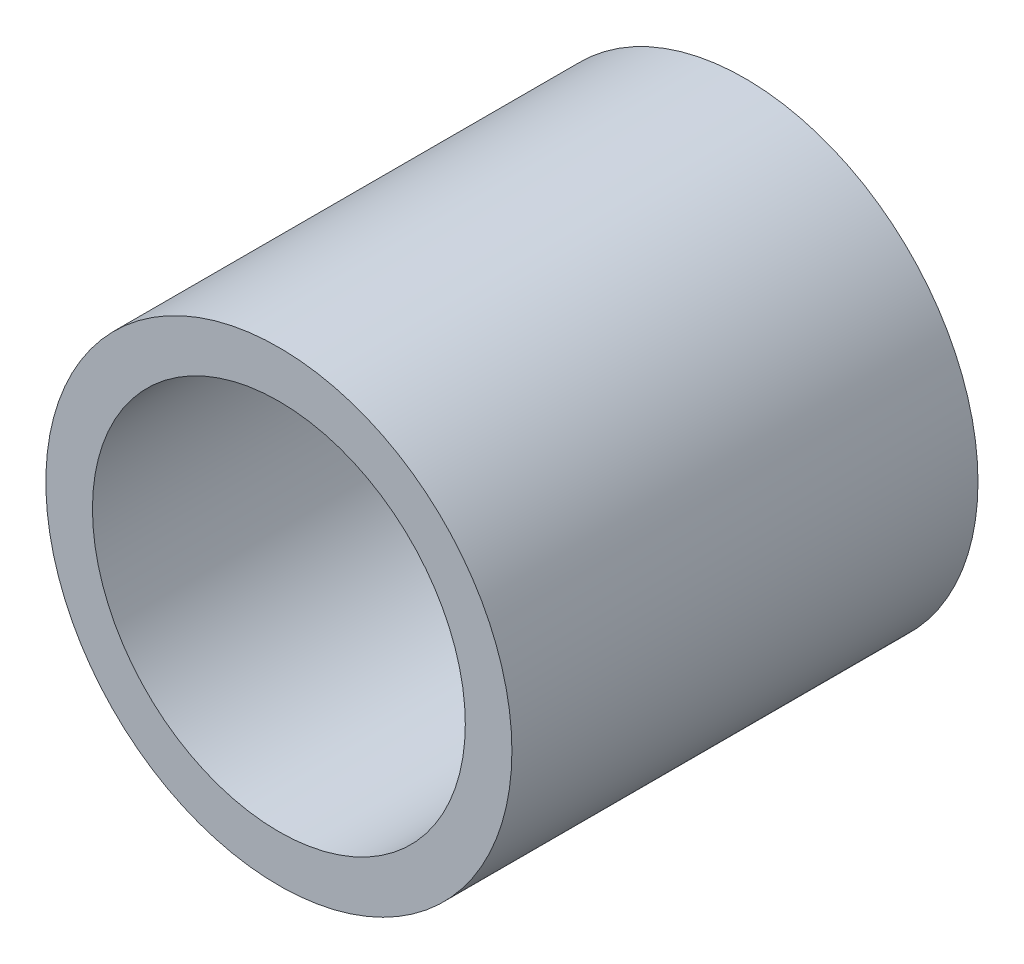
ISO-10303-21;
HEADER;
FILE_DESCRIPTION(('STEP AP214'),'2;1');
FILE_NAME('part.step','',(''),(''),'','','');
FILE_SCHEMA(('AUTOMOTIVE_DESIGN { 1 0 10303 214 1 1 1 1 }'));
ENDSEC;
DATA;
#1=APPLICATION_CONTEXT('core data for automotive mechanical design processes');
#2=APPLICATION_PROTOCOL_DEFINITION('international standard','automotive_design',2000,#1);
#3=PRODUCT_CONTEXT('',#1,'mechanical');
#4=PRODUCT('Part','Part','',(#3));
#5=PRODUCT_RELATED_PRODUCT_CATEGORY('part','',(#4));
#6=PRODUCT_DEFINITION_FORMATION('','',#4);
#7=PRODUCT_DEFINITION_CONTEXT('part definition',#1,'design');
#8=PRODUCT_DEFINITION('design','',#6,#7);
#9=PRODUCT_DEFINITION_SHAPE('','',#8);
#10=(LENGTH_UNIT() NAMED_UNIT(*) SI_UNIT(.MILLI.,.METRE.));
#11=(NAMED_UNIT(*) PLANE_ANGLE_UNIT() SI_UNIT($,.RADIAN.));
#12=(NAMED_UNIT(*) SI_UNIT($,.STERADIAN.) SOLID_ANGLE_UNIT());
#13=UNCERTAINTY_MEASURE_WITH_UNIT(LENGTH_MEASURE(1.E-05),#10,'distance_accuracy_value','');
#14=(GEOMETRIC_REPRESENTATION_CONTEXT(3) GLOBAL_UNCERTAINTY_ASSIGNED_CONTEXT((#13)) GLOBAL_UNIT_ASSIGNED_CONTEXT((#10,
#11,#12)) REPRESENTATION_CONTEXT('',''));
#15=CARTESIAN_POINT('',(0.,0.,0.));
#16=DIRECTION('',(0.,0.,1.));
#17=DIRECTION('',(1.,0.,0.));
#18=AXIS2_PLACEMENT_3D('',#15,#16,#17);
#19=CARTESIAN_POINT('',(0.,0.,5.));
#20=DIRECTION('',(0.,0.,-1.));
#21=DIRECTION('',(-1.,0.,0.));
#22=AXIS2_PLACEMENT_3D('',#19,#20,#21);
#23=CYLINDRICAL_SURFACE('',#22,2.5);
#24=CARTESIAN_POINT('',(0.,0.,5.));
#25=DIRECTION('',(0.,0.,1.));
#26=DIRECTION('',(1.,0.,0.));
#27=AXIS2_PLACEMENT_3D('',#24,#25,#26);
#28=CIRCLE('',#27,2.5);
#29=CARTESIAN_POINT('',(2.5,0.,5.));
#30=VERTEX_POINT('',#29);
#31=EDGE_CURVE('E10',#30,#30,#28,.T.);
#32=ORIENTED_EDGE('',*,*,#31,.F.);
#33=EDGE_LOOP('',(#32));
#34=FACE_BOUND('',#33,.T.);
#35=CARTESIAN_POINT('',(0.,0.,0.));
#36=DIRECTION('',(0.,0.,1.));
#37=DIRECTION('',(1.,0.,0.));
#38=AXIS2_PLACEMENT_3D('',#35,#36,#37);
#39=CIRCLE('',#38,2.5);
#40=CARTESIAN_POINT('',(2.5,0.,0.));
#41=VERTEX_POINT('',#40);
#42=EDGE_CURVE('E46',#41,#41,#39,.T.);
#43=ORIENTED_EDGE('',*,*,#42,.T.);
#44=EDGE_LOOP('',(#43));
#45=FACE_BOUND('',#44,.T.);
#46=ADVANCED_FACE('F37',(#34,#45),#23,.T.);
#47=CARTESIAN_POINT('',(0.,0.,5.));
#48=DIRECTION('',(0.,0.,1.));
#49=DIRECTION('',(1.,0.,0.));
#50=AXIS2_PLACEMENT_3D('',#47,#48,#49);
#51=PLANE('',#50);
#52=CARTESIAN_POINT('',(0.,0.,5.));
#53=DIRECTION('',(0.,0.,1.));
#54=DIRECTION('',(1.,0.,0.));
#55=AXIS2_PLACEMENT_3D('',#52,#53,#54);
#56=CIRCLE('',#55,2.);
#57=CARTESIAN_POINT('',(2.,0.,5.));
#58=VERTEX_POINT('',#57);
#59=EDGE_CURVE('E54',#58,#58,#56,.T.);
#60=ORIENTED_EDGE('',*,*,#59,.F.);
#61=EDGE_LOOP('',(#60));
#62=FACE_BOUND('',#61,.T.);
#63=ORIENTED_EDGE('',*,*,#31,.T.);
#64=EDGE_LOOP('',(#63));
#65=FACE_BOUND('',#64,.T.);
#66=ADVANCED_FACE('F83',(#62,#65),#51,.T.);
#67=CARTESIAN_POINT('',(0.,0.,0.));
#68=DIRECTION('',(0.,0.,1.));
#69=DIRECTION('',(1.,0.,0.));
#70=AXIS2_PLACEMENT_3D('',#67,#68,#69);
#71=PLANE('',#70);
#72=CARTESIAN_POINT('',(0.,0.,0.));
#73=DIRECTION('',(0.,0.,1.));
#74=DIRECTION('',(1.,0.,0.));
#75=AXIS2_PLACEMENT_3D('',#72,#73,#74);
#76=CIRCLE('',#75,1.);
#77=CARTESIAN_POINT('',(1.,0.,0.));
#78=VERTEX_POINT('',#77);
#79=EDGE_CURVE('E41',#78,#78,#76,.T.);
#80=ORIENTED_EDGE('',*,*,#79,.T.);
#81=EDGE_LOOP('',(#80));
#82=FACE_BOUND('',#81,.T.);
#83=ORIENTED_EDGE('',*,*,#42,.F.);
#84=EDGE_LOOP('',(#83));
#85=FACE_BOUND('',#84,.T.);
#86=ADVANCED_FACE('F39',(#82,#85),#71,.F.);
#87=CARTESIAN_POINT('',(0.,0.,1.6));
#88=DIRECTION('',(0.,0.,1.));
#89=DIRECTION('',(1.,0.,0.));
#90=AXIS2_PLACEMENT_3D('',#87,#88,#89);
#91=CYLINDRICAL_SURFACE('',#90,2.);
#92=CARTESIAN_POINT('',(0.,0.,1.6));
#93=DIRECTION('',(0.,0.,1.));
#94=DIRECTION('',(1.,0.,0.));
#95=AXIS2_PLACEMENT_3D('',#92,#93,#94);
#96=CIRCLE('',#95,2.);
#97=CARTESIAN_POINT('',(2.,0.,1.6));
#98=VERTEX_POINT('',#97);
#99=EDGE_CURVE('E52',#98,#98,#96,.T.);
#100=ORIENTED_EDGE('',*,*,#99,.F.);
#101=EDGE_LOOP('',(#100));
#102=FACE_BOUND('',#101,.T.);
#103=ORIENTED_EDGE('',*,*,#59,.T.);
#104=EDGE_LOOP('',(#103));
#105=FACE_BOUND('',#104,.T.);
#106=ADVANCED_FACE('F79',(#102,#105),#91,.F.);
#107=CARTESIAN_POINT('',(0.,0.,1.6));
#108=DIRECTION('',(0.,0.,1.));
#109=DIRECTION('',(1.,0.,0.));
#110=AXIS2_PLACEMENT_3D('',#107,#108,#109);
#111=PLANE('',#110);
#112=CARTESIAN_POINT('',(0.,0.,1.6));
#113=DIRECTION('',(0.,0.,1.));
#114=DIRECTION('',(1.,0.,0.));
#115=AXIS2_PLACEMENT_3D('',#112,#113,#114);
#116=CIRCLE('',#115,1.);
#117=CARTESIAN_POINT('',(1.,0.,1.6));
#118=VERTEX_POINT('',#117);
#119=EDGE_CURVE('E61',#118,#118,#116,.T.);
#120=ORIENTED_EDGE('',*,*,#119,.F.);
#121=EDGE_LOOP('',(#120));
#122=FACE_BOUND('',#121,.T.);
#123=ORIENTED_EDGE('',*,*,#99,.T.);
#124=EDGE_LOOP('',(#123));
#125=FACE_BOUND('',#124,.T.);
#126=ADVANCED_FACE('F74',(#122,#125),#111,.T.);
#127=CARTESIAN_POINT('',(0.,0.,-1.8));
#128=DIRECTION('',(0.,0.,1.));
#129=DIRECTION('',(1.,0.,0.));
#130=AXIS2_PLACEMENT_3D('',#127,#128,#129);
#131=CYLINDRICAL_SURFACE('',#130,1.);
#132=ORIENTED_EDGE('',*,*,#119,.T.);
#133=EDGE_LOOP('',(#132));
#134=FACE_BOUND('',#133,.T.);
#135=ORIENTED_EDGE('',*,*,#79,.F.);
#136=EDGE_LOOP('',(#135));
#137=FACE_BOUND('',#136,.T.);
#138=ADVANCED_FACE('F72',(#134,#137),#131,.F.);
#139=CLOSED_SHELL('',(#46,#66,#86,#106,#126,#138));
#140=MANIFOLD_SOLID_BREP('B2',#139);
#141=ADVANCED_BREP_SHAPE_REPRESENTATION('',(#18,#140),#14);
#142=SHAPE_DEFINITION_REPRESENTATION(#9,#141);
ENDSEC;
END-ISO-10303-21;
